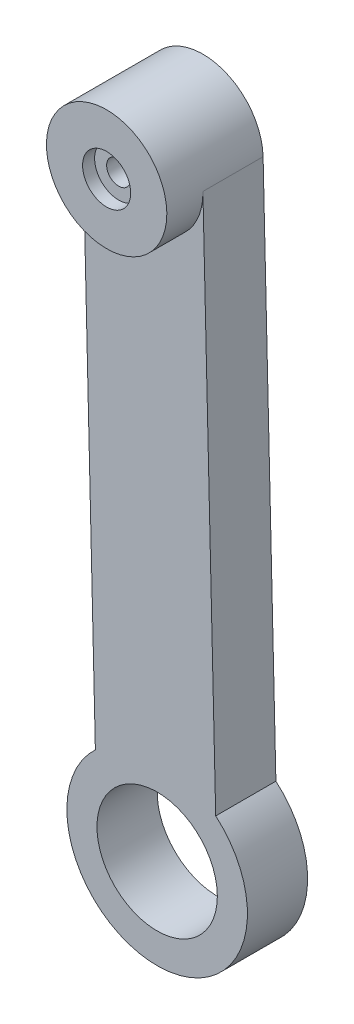
ISO-10303-21;
HEADER;
FILE_DESCRIPTION(('STEP AP214'),'2;1');
FILE_NAME('part.step','',(''),(''),'','','');
FILE_SCHEMA(('AUTOMOTIVE_DESIGN { 1 0 10303 214 1 1 1 1 }'));
ENDSEC;
DATA;
#1=APPLICATION_CONTEXT('core data for automotive mechanical design processes');
#2=APPLICATION_PROTOCOL_DEFINITION('international standard','automotive_design',2000,#1);
#3=PRODUCT_CONTEXT('',#1,'mechanical');
#4=PRODUCT('Part','Part','',(#3));
#5=PRODUCT_RELATED_PRODUCT_CATEGORY('part','',(#4));
#6=PRODUCT_DEFINITION_FORMATION('','',#4);
#7=PRODUCT_DEFINITION_CONTEXT('part definition',#1,'design');
#8=PRODUCT_DEFINITION('design','',#6,#7);
#9=PRODUCT_DEFINITION_SHAPE('','',#8);
#10=(LENGTH_UNIT() NAMED_UNIT(*) SI_UNIT(.MILLI.,.METRE.));
#11=(NAMED_UNIT(*) PLANE_ANGLE_UNIT() SI_UNIT($,.RADIAN.));
#12=(NAMED_UNIT(*) SI_UNIT($,.STERADIAN.) SOLID_ANGLE_UNIT());
#13=UNCERTAINTY_MEASURE_WITH_UNIT(LENGTH_MEASURE(1.E-05),#10,'distance_accuracy_value','');
#14=(GEOMETRIC_REPRESENTATION_CONTEXT(3) GLOBAL_UNCERTAINTY_ASSIGNED_CONTEXT((#13)) GLOBAL_UNIT_ASSIGNED_CONTEXT((#10,
#11,#12)) REPRESENTATION_CONTEXT('',''));
#15=CARTESIAN_POINT('',(0.,0.,0.));
#16=DIRECTION('',(0.,0.,1.));
#17=DIRECTION('',(1.,0.,0.));
#18=AXIS2_PLACEMENT_3D('',#15,#16,#17);
#19=CARTESIAN_POINT('',(3.81228890551644,50.0856410677582,8.));
#20=DIRECTION('',(0.,0.,-1.));
#21=DIRECTION('',(-1.,0.,0.));
#22=AXIS2_PLACEMENT_3D('',#19,#20,#21);
#23=CYLINDRICAL_SURFACE('',#22,1.);
#24=CARTESIAN_POINT('',(3.81228890551644,50.0856410677582,5.));
#25=DIRECTION('',(0.,0.,1.));
#26=DIRECTION('',(1.,0.,0.));
#27=AXIS2_PLACEMENT_3D('',#24,#25,#26);
#28=CIRCLE('',#27,1.);
#29=CARTESIAN_POINT('',(4.81228890551644,50.0856410677582,5.));
#30=VERTEX_POINT('',#29);
#31=EDGE_CURVE('E214',#30,#30,#28,.T.);
#32=ORIENTED_EDGE('',*,*,#31,.F.);
#33=EDGE_LOOP('',(#32));
#34=FACE_BOUND('',#33,.T.);
#35=CARTESIAN_POINT('',(3.81228890551644,50.0856410677582,7.));
#36=DIRECTION('',(0.,0.,1.));
#37=DIRECTION('',(1.,0.,0.));
#38=AXIS2_PLACEMENT_3D('',#35,#36,#37);
#39=CIRCLE('',#38,1.);
#40=CARTESIAN_POINT('',(4.81228890551644,50.0856410677582,7.));
#41=VERTEX_POINT('',#40);
#42=EDGE_CURVE('E78',#41,#41,#39,.T.);
#43=ORIENTED_EDGE('',*,*,#42,.T.);
#44=EDGE_LOOP('',(#43));
#45=FACE_BOUND('',#44,.T.);
#46=ADVANCED_FACE('F74',(#34,#45),#23,.F.);
#47=CARTESIAN_POINT('',(5.00908162030334,0.0999662478877145,5.));
#48=DIRECTION('',(0.,0.,-1.));
#49=DIRECTION('',(0.,1.,0.));
#50=AXIS2_PLACEMENT_3D('',#47,#48,#49);
#51=CYLINDRICAL_SURFACE('',#50,5.);
#52=CARTESIAN_POINT('',(5.00908162030334,0.0999662478877145,0.));
#53=DIRECTION('',(0.,0.,1.));
#54=DIRECTION('',(1.,0.,0.));
#55=AXIS2_PLACEMENT_3D('',#52,#53,#54);
#56=CIRCLE('',#55,5.);
#57=CARTESIAN_POINT('',(10.0090816203033,0.0999662478877145,0.));
#58=VERTEX_POINT('',#57);
#59=EDGE_CURVE('E156',#58,#58,#56,.T.);
#60=ORIENTED_EDGE('',*,*,#59,.F.);
#61=EDGE_LOOP('',(#60));
#62=FACE_BOUND('',#61,.T.);
#63=CARTESIAN_POINT('',(5.00908162030334,0.0999662478877145,5.));
#64=DIRECTION('',(0.,0.,1.));
#65=DIRECTION('',(1.,0.,0.));
#66=AXIS2_PLACEMENT_3D('',#63,#64,#65);
#67=CIRCLE('',#66,5.);
#68=CARTESIAN_POINT('',(10.0090816203033,0.0999662478877145,5.));
#69=VERTEX_POINT('',#68);
#70=EDGE_CURVE('E125',#69,#69,#67,.T.);
#71=ORIENTED_EDGE('',*,*,#70,.T.);
#72=EDGE_LOOP('',(#71));
#73=FACE_BOUND('',#72,.T.);
#74=ADVANCED_FACE('F170',(#62,#73),#51,.F.);
#75=CARTESIAN_POINT('',(0.,0.,0.));
#76=DIRECTION('',(0.,0.,1.));
#77=DIRECTION('',(1.,0.,0.));
#78=AXIS2_PLACEMENT_3D('',#75,#76,#77);
#79=PLANE('',#78);
#80=ORIENTED_EDGE('',*,*,#59,.T.);
#81=EDGE_LOOP('',(#80));
#82=FACE_BOUND('',#81,.T.);
#83=CARTESIAN_POINT('',(5.00908162030334,0.0999662478877145,0.));
#84=DIRECTION('',(0.,0.,1.));
#85=DIRECTION('',(0.,-1.,0.));
#86=AXIS2_PLACEMENT_3D('',#83,#84,#85);
#87=CIRCLE('',#86,7.5);
#88=CARTESIAN_POINT('',(-0.123291354945696,5.56885531633054,0.));
#89=VERTEX_POINT('',#88);
#90=CARTESIAN_POINT('',(9.87384360902839,5.8082138592879,0.));
#91=VERTEX_POINT('',#90);
#92=EDGE_CURVE('E162',#89,#91,#87,.T.);
#93=ORIENTED_EDGE('',*,*,#92,.F.);
#94=DIRECTION('',(0.0239358542957358,-0.99971349639741,0.));
#95=VECTOR('',#94,1.);
#96=CARTESIAN_POINT('',(0.0100364016280964,0.000240298693464976,0.));
#97=LINE('',#96,#95);
#98=CARTESIAN_POINT('',(-1.18627857647049,49.9659617962795,0.));
#99=VERTEX_POINT('',#98);
#100=EDGE_CURVE('E154',#99,#89,#97,.T.);
#101=ORIENTED_EDGE('',*,*,#100,.F.);
#102=CARTESIAN_POINT('',(3.81228890551655,50.0856410677582,0.));
#103=DIRECTION('',(0.,0.,1.));
#104=DIRECTION('',(1.,0.,0.));
#105=AXIS2_PLACEMENT_3D('',#102,#103,#104);
#106=CIRCLE('',#105,5.);
#107=CARTESIAN_POINT('',(8.8108563875036,50.2053203392368,0.));
#108=VERTEX_POINT('',#107);
#109=EDGE_CURVE('E139',#108,#99,#106,.T.);
#110=ORIENTED_EDGE('',*,*,#109,.F.);
#111=DIRECTION('',(0.0239358542957358,-0.99971349639741,0.));
#112=VECTOR('',#111,1.);
#113=CARTESIAN_POINT('',(10.0071713656022,0.239598841650823,0.));
#114=LINE('',#113,#112);
#115=EDGE_CURVE('E131',#108,#91,#114,.T.);
#116=ORIENTED_EDGE('',*,*,#115,.T.);
#117=EDGE_LOOP('',(#93,#101,#110,#116));
#118=FACE_BOUND('',#117,.T.);
#119=CARTESIAN_POINT('',(3.81228890551656,50.0856410677582,0.));
#120=DIRECTION('',(0.,0.,1.));
#121=DIRECTION('',(1.,0.,0.));
#122=AXIS2_PLACEMENT_3D('',#119,#120,#121);
#123=CIRCLE('',#122,2.4);
#124=CARTESIAN_POINT('',(6.21228890551656,50.0856410677582,0.));
#125=VERTEX_POINT('',#124);
#126=EDGE_CURVE('E144',#125,#125,#123,.F.);
#127=ORIENTED_EDGE('',*,*,#126,.F.);
#128=EDGE_LOOP('',(#127));
#129=FACE_BOUND('',#128,.T.);
#130=ADVANCED_FACE('F167',(#82,#118,#129),#79,.F.);
#131=CARTESIAN_POINT('',(0.,0.,5.));
#132=DIRECTION('',(0.,0.,1.));
#133=DIRECTION('',(1.,0.,0.));
#134=AXIS2_PLACEMENT_3D('',#131,#132,#133);
#135=PLANE('',#134);
#136=CARTESIAN_POINT('',(3.81228890551644,50.0856410677582,5.));
#137=DIRECTION('',(0.,0.,1.));
#138=DIRECTION('',(1.,0.,0.));
#139=AXIS2_PLACEMENT_3D('',#136,#137,#138);
#140=CIRCLE('',#139,5.0000000000001);
#141=CARTESIAN_POINT('',(-1.18627857647049,49.9659617962795,5.));
#142=VERTEX_POINT('',#141);
#143=CARTESIAN_POINT('',(8.81085638750358,50.2053203392368,5.));
#144=VERTEX_POINT('',#143);
#145=EDGE_CURVE('E14',#142,#144,#140,.T.);
#146=ORIENTED_EDGE('',*,*,#145,.F.);
#147=DIRECTION('',(0.0239358542957358,-0.99971349639741,0.));
#148=VECTOR('',#147,1.);
#149=CARTESIAN_POINT('',(0.0100364016280964,0.000240298693464976,5.));
#150=LINE('',#149,#148);
#151=CARTESIAN_POINT('',(-0.123291354945696,5.56885531633054,5.));
#152=VERTEX_POINT('',#151);
#153=EDGE_CURVE('E142',#142,#152,#150,.T.);
#154=ORIENTED_EDGE('',*,*,#153,.T.);
#155=CARTESIAN_POINT('',(5.00908162030334,0.0999662478877145,5.));
#156=DIRECTION('',(0.,0.,1.));
#157=DIRECTION('',(0.,-1.,0.));
#158=AXIS2_PLACEMENT_3D('',#155,#156,#157);
#159=CIRCLE('',#158,7.5);
#160=CARTESIAN_POINT('',(9.87384360902839,5.8082138592879,5.));
#161=VERTEX_POINT('',#160);
#162=EDGE_CURVE('E122',#152,#161,#159,.T.);
#163=ORIENTED_EDGE('',*,*,#162,.T.);
#164=DIRECTION('',(0.0239358542957358,-0.99971349639741,0.));
#165=VECTOR('',#164,1.);
#166=CARTESIAN_POINT('',(10.0071713656022,0.239598841650823,5.));
#167=LINE('',#166,#165);
#168=EDGE_CURVE('E116',#144,#161,#167,.T.);
#169=ORIENTED_EDGE('',*,*,#168,.F.);
#170=EDGE_LOOP('',(#146,#154,#163,#169));
#171=FACE_BOUND('',#170,.T.);
#172=ORIENTED_EDGE('',*,*,#70,.F.);
#173=EDGE_LOOP('',(#172));
#174=FACE_BOUND('',#173,.T.);
#175=ADVANCED_FACE('F118',(#171,#174),#135,.T.);
#176=CARTESIAN_POINT('',(10.0071713656022,0.239598841650823,5.));
#177=DIRECTION('',(0.999713496397409,0.0239358542957358,0.));
#178=DIRECTION('',(-0.0239358542957358,0.999713496397409,0.));
#179=AXIS2_PLACEMENT_3D('',#176,#177,#178);
#180=PLANE('',#179);
#181=ORIENTED_EDGE('',*,*,#168,.T.);
#182=DIRECTION('',(0.,0.,-1.));
#183=VECTOR('',#182,1.);
#184=CARTESIAN_POINT('',(9.87384360902839,5.8082138592879,5.));
#185=LINE('',#184,#183);
#186=EDGE_CURVE('E91',#161,#91,#185,.T.);
#187=ORIENTED_EDGE('',*,*,#186,.T.);
#188=ORIENTED_EDGE('',*,*,#115,.F.);
#189=DIRECTION('',(0.,0.,-1.));
#190=VECTOR('',#189,1.);
#191=CARTESIAN_POINT('',(8.8108563875036,50.2053203392368,5.));
#192=LINE('',#191,#190);
#193=EDGE_CURVE('E128',#144,#108,#192,.T.);
#194=ORIENTED_EDGE('',*,*,#193,.F.);
#195=EDGE_LOOP('',(#181,#187,#188,#194));
#196=FACE_BOUND('',#195,.T.);
#197=ADVANCED_FACE('F129',(#196),#180,.T.);
#198=CARTESIAN_POINT('',(3.81228890551655,50.0856410677582,5.));
#199=DIRECTION('',(0.,0.,-1.));
#200=DIRECTION('',(0.,1.,0.));
#201=AXIS2_PLACEMENT_3D('',#198,#199,#200);
#202=CYLINDRICAL_SURFACE('',#201,5.);
#203=ORIENTED_EDGE('',*,*,#109,.T.);
#204=DIRECTION('',(0.,0.,-1.));
#205=VECTOR('',#204,1.);
#206=CARTESIAN_POINT('',(-1.18627857647049,49.9659617962795,5.));
#207=LINE('',#206,#205);
#208=EDGE_CURVE('E134',#142,#99,#207,.T.);
#209=ORIENTED_EDGE('',*,*,#208,.F.);
#210=ORIENTED_EDGE('',*,*,#145,.T.);
#211=ORIENTED_EDGE('',*,*,#193,.T.);
#212=EDGE_LOOP('',(#203,#209,#210,#211));
#213=FACE_BOUND('',#212,.T.);
#214=CARTESIAN_POINT('',(3.81228890551644,50.0856410677582,8.));
#215=DIRECTION('',(0.,0.,1.));
#216=DIRECTION('',(1.,0.,0.));
#217=AXIS2_PLACEMENT_3D('',#214,#215,#216);
#218=CIRCLE('',#217,5.0000000000001);
#219=CARTESIAN_POINT('',(8.81228890551654,50.0856410677582,8.));
#220=VERTEX_POINT('',#219);
#221=EDGE_CURVE('E164',#220,#220,#218,.T.);
#222=ORIENTED_EDGE('',*,*,#221,.F.);
#223=EDGE_LOOP('',(#222));
#224=FACE_BOUND('',#223,.T.);
#225=ADVANCED_FACE('F136',(#213,#224),#202,.T.);
#226=CARTESIAN_POINT('',(0.0100364016280964,0.000240298693464976,5.));
#227=DIRECTION('',(0.999713496397409,0.0239358542957358,0.));
#228=DIRECTION('',(-0.0239358542957358,0.999713496397409,0.));
#229=AXIS2_PLACEMENT_3D('',#226,#227,#228);
#230=PLANE('',#229);
#231=DIRECTION('',(0.,0.,-1.));
#232=VECTOR('',#231,1.);
#233=CARTESIAN_POINT('',(-0.123291354945694,5.56885531633054,5.));
#234=LINE('',#233,#232);
#235=EDGE_CURVE('E83',#152,#89,#234,.T.);
#236=ORIENTED_EDGE('',*,*,#235,.F.);
#237=ORIENTED_EDGE('',*,*,#153,.F.);
#238=ORIENTED_EDGE('',*,*,#208,.T.);
#239=ORIENTED_EDGE('',*,*,#100,.T.);
#240=EDGE_LOOP('',(#236,#237,#238,#239));
#241=FACE_BOUND('',#240,.T.);
#242=ADVANCED_FACE('F143',(#241),#230,.F.);
#243=CARTESIAN_POINT('',(3.81228890551656,50.0856410677582,5.));
#244=DIRECTION('',(0.,0.,-1.));
#245=DIRECTION('',(0.,1.,0.));
#246=AXIS2_PLACEMENT_3D('',#243,#244,#245);
#247=CYLINDRICAL_SURFACE('',#246,2.4);
#248=CARTESIAN_POINT('',(3.81228890551656,50.0856410677582,5.));
#249=DIRECTION('',(0.,0.,1.));
#250=DIRECTION('',(1.,0.,0.));
#251=AXIS2_PLACEMENT_3D('',#248,#249,#250);
#252=CIRCLE('',#251,2.4);
#253=CARTESIAN_POINT('',(6.21228890551656,50.0856410677582,5.));
#254=VERTEX_POINT('',#253);
#255=EDGE_CURVE('E124',#254,#254,#252,.F.);
#256=ORIENTED_EDGE('',*,*,#255,.F.);
#257=EDGE_LOOP('',(#256));
#258=FACE_BOUND('',#257,.T.);
#259=ORIENTED_EDGE('',*,*,#126,.T.);
#260=EDGE_LOOP('',(#259));
#261=FACE_BOUND('',#260,.T.);
#262=ADVANCED_FACE('F175',(#258,#261),#247,.F.);
#263=CARTESIAN_POINT('',(5.00908162030334,0.0999662478877145,5.));
#264=DIRECTION('',(0.,0.,-1.));
#265=DIRECTION('',(0.,1.,0.));
#266=AXIS2_PLACEMENT_3D('',#263,#264,#265);
#267=CYLINDRICAL_SURFACE('',#266,7.5);
#268=ORIENTED_EDGE('',*,*,#162,.F.);
#269=ORIENTED_EDGE('',*,*,#235,.T.);
#270=ORIENTED_EDGE('',*,*,#92,.T.);
#271=ORIENTED_EDGE('',*,*,#186,.F.);
#272=EDGE_LOOP('',(#268,#269,#270,#271));
#273=FACE_BOUND('',#272,.T.);
#274=ADVANCED_FACE('F76',(#273),#267,.T.);
#275=CARTESIAN_POINT('',(3.81228890551644,50.0856410677582,5.));
#276=DIRECTION('',(0.,0.,1.));
#277=DIRECTION('',(1.,0.,0.));
#278=AXIS2_PLACEMENT_3D('',#275,#276,#277);
#279=PLANE('',#278);
#280=ORIENTED_EDGE('',*,*,#31,.T.);
#281=EDGE_LOOP('',(#280));
#282=FACE_BOUND('',#281,.T.);
#283=ORIENTED_EDGE('',*,*,#255,.T.);
#284=EDGE_LOOP('',(#283));
#285=FACE_BOUND('',#284,.T.);
#286=ADVANCED_FACE('F183',(#282,#285),#279,.F.);
#287=CARTESIAN_POINT('',(3.81228890551644,50.0856410677582,8.));
#288=DIRECTION('',(0.,0.,1.));
#289=DIRECTION('',(1.,0.,0.));
#290=AXIS2_PLACEMENT_3D('',#287,#288,#289);
#291=PLANE('',#290);
#292=CARTESIAN_POINT('',(3.81228890551644,50.0856410677582,8.));
#293=DIRECTION('',(0.,0.,1.));
#294=DIRECTION('',(1.,0.,0.));
#295=AXIS2_PLACEMENT_3D('',#292,#293,#294);
#296=CIRCLE('',#295,2.);
#297=CARTESIAN_POINT('',(5.81228890551644,50.0856410677582,8.));
#298=VERTEX_POINT('',#297);
#299=EDGE_CURVE('E222',#298,#298,#296,.T.);
#300=ORIENTED_EDGE('',*,*,#299,.F.);
#301=EDGE_LOOP('',(#300));
#302=FACE_BOUND('',#301,.T.);
#303=ORIENTED_EDGE('',*,*,#221,.T.);
#304=EDGE_LOOP('',(#303));
#305=FACE_BOUND('',#304,.T.);
#306=ADVANCED_FACE('F204',(#302,#305),#291,.T.);
#307=CARTESIAN_POINT('',(3.81228890551644,50.0856410677582,-0.656854249492383));
#308=DIRECTION('',(0.,0.,1.));
#309=DIRECTION('',(1.,0.,0.));
#310=AXIS2_PLACEMENT_3D('',#307,#308,#309);
#311=CYLINDRICAL_SURFACE('',#310,2.);
#312=CARTESIAN_POINT('',(3.81228890551644,50.0856410677582,7.));
#313=DIRECTION('',(0.,0.,1.));
#314=DIRECTION('',(1.,0.,0.));
#315=AXIS2_PLACEMENT_3D('',#312,#313,#314);
#316=CIRCLE('',#315,2.);
#317=CARTESIAN_POINT('',(5.81228890551644,50.0856410677582,7.));
#318=VERTEX_POINT('',#317);
#319=EDGE_CURVE('E218',#318,#318,#316,.F.);
#320=ORIENTED_EDGE('',*,*,#319,.T.);
#321=EDGE_LOOP('',(#320));
#322=FACE_BOUND('',#321,.T.);
#323=ORIENTED_EDGE('',*,*,#299,.T.);
#324=EDGE_LOOP('',(#323));
#325=FACE_BOUND('',#324,.T.);
#326=ADVANCED_FACE('F202',(#322,#325),#311,.F.);
#327=CARTESIAN_POINT('',(0.,0.,7.));
#328=DIRECTION('',(0.,0.,1.));
#329=DIRECTION('',(1.,0.,0.));
#330=AXIS2_PLACEMENT_3D('',#327,#328,#329);
#331=PLANE('',#330);
#332=ORIENTED_EDGE('',*,*,#42,.F.);
#333=EDGE_LOOP('',(#332));
#334=FACE_BOUND('',#333,.T.);
#335=ORIENTED_EDGE('',*,*,#319,.F.);
#336=EDGE_LOOP('',(#335));
#337=FACE_BOUND('',#336,.T.);
#338=ADVANCED_FACE('F268',(#334,#337),#331,.T.);
#339=CLOSED_SHELL('',(#46,#74,#130,#175,#197,#225,#242,#262,#274,#286,#306,#326,#338));
#340=MANIFOLD_SOLID_BREP('B2',#339);
#341=ADVANCED_BREP_SHAPE_REPRESENTATION('',(#18,#340),#14);
#342=SHAPE_DEFINITION_REPRESENTATION(#9,#341);
ENDSEC;
END-ISO-10303-21;
